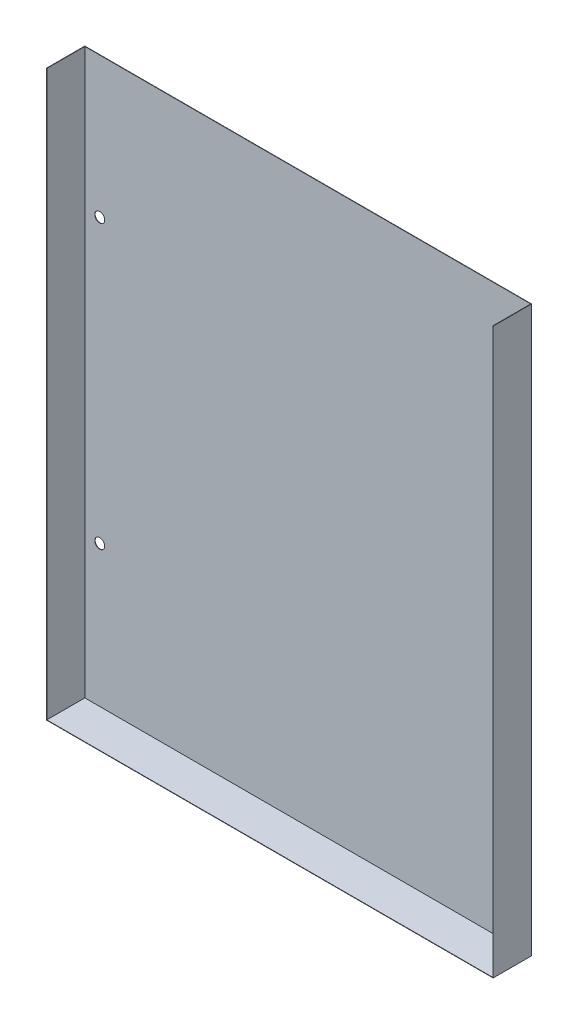
ISO-10303-21;
HEADER;
FILE_DESCRIPTION(('STEP AP214'),'2;1');
FILE_NAME('part.step','',(''),(''),'','','');
FILE_SCHEMA(('AUTOMOTIVE_DESIGN { 1 0 10303 214 1 1 1 1 }'));
ENDSEC;
DATA;
#1=APPLICATION_CONTEXT('core data for automotive mechanical design processes');
#2=APPLICATION_PROTOCOL_DEFINITION('international standard','automotive_design',2000,#1);
#3=PRODUCT_CONTEXT('',#1,'mechanical');
#4=PRODUCT('Part','Part','',(#3));
#5=PRODUCT_RELATED_PRODUCT_CATEGORY('part','',(#4));
#6=PRODUCT_DEFINITION_FORMATION('','',#4);
#7=PRODUCT_DEFINITION_CONTEXT('part definition',#1,'design');
#8=PRODUCT_DEFINITION('design','',#6,#7);
#9=PRODUCT_DEFINITION_SHAPE('','',#8);
#10=(LENGTH_UNIT() NAMED_UNIT(*) SI_UNIT(.MILLI.,.METRE.));
#11=(NAMED_UNIT(*) PLANE_ANGLE_UNIT() SI_UNIT($,.RADIAN.));
#12=(NAMED_UNIT(*) SI_UNIT($,.STERADIAN.) SOLID_ANGLE_UNIT());
#13=UNCERTAINTY_MEASURE_WITH_UNIT(LENGTH_MEASURE(1.E-05),#10,'distance_accuracy_value','');
#14=(GEOMETRIC_REPRESENTATION_CONTEXT(3) GLOBAL_UNCERTAINTY_ASSIGNED_CONTEXT((#13)) GLOBAL_UNIT_ASSIGNED_CONTEXT((#10,
#11,#12)) REPRESENTATION_CONTEXT('',''));
#15=CARTESIAN_POINT('',(0.,0.,0.));
#16=DIRECTION('',(0.,0.,1.));
#17=DIRECTION('',(1.,0.,0.));
#18=AXIS2_PLACEMENT_3D('',#15,#16,#17);
#19=CARTESIAN_POINT('',(0.,113.5,0.1524));
#20=DIRECTION('',(0.,1.,0.));
#21=DIRECTION('',(-1.,0.,0.));
#22=AXIS2_PLACEMENT_3D('',#19,#20,#21);
#23=PLANE('',#22);
#24=DIRECTION('',(1.,0.,0.));
#25=VECTOR('',#24,1.);
#26=CARTESIAN_POINT('',(0.,113.5,0.));
#27=LINE('',#26,#25);
#28=CARTESIAN_POINT('',(-89.8724,113.5,0.));
#29=VERTEX_POINT('',#28);
#30=CARTESIAN_POINT('',(89.8724,113.5,0.));
#31=VERTEX_POINT('',#30);
#32=EDGE_CURVE('E43',#29,#31,#27,.T.);
#33=ORIENTED_EDGE('',*,*,#32,.F.);
#34=DIRECTION('',(0.,0.,-1.));
#35=VECTOR('',#34,1.);
#36=CARTESIAN_POINT('',(-89.8724,113.5,15.45166));
#37=LINE('',#36,#35);
#38=CARTESIAN_POINT('',(-89.8724,113.5,15.45166));
#39=VERTEX_POINT('',#38);
#40=EDGE_CURVE('E173',#39,#29,#37,.T.);
#41=ORIENTED_EDGE('',*,*,#40,.F.);
#42=DIRECTION('',(-1.,0.,0.));
#43=VECTOR('',#42,1.);
#44=CARTESIAN_POINT('',(-89.8724,113.5,15.45166));
#45=LINE('',#44,#43);
#46=CARTESIAN_POINT('',(-89.72,113.5,15.45166));
#47=VERTEX_POINT('',#46);
#48=EDGE_CURVE('E167',#47,#39,#45,.T.);
#49=ORIENTED_EDGE('',*,*,#48,.F.);
#50=DIRECTION('',(0.,0.,-1.));
#51=VECTOR('',#50,1.);
#52=CARTESIAN_POINT('',(-89.72,113.5,15.45166));
#53=LINE('',#52,#51);
#54=CARTESIAN_POINT('',(-89.72,113.5,0.1524));
#55=VERTEX_POINT('',#54);
#56=EDGE_CURVE('E176',#47,#55,#53,.T.);
#57=ORIENTED_EDGE('',*,*,#56,.T.);
#58=DIRECTION('',(1.,0.,0.));
#59=VECTOR('',#58,1.);
#60=CARTESIAN_POINT('',(0.,113.5,0.1524));
#61=LINE('',#60,#59);
#62=CARTESIAN_POINT('',(89.72,113.5,0.1524));
#63=VERTEX_POINT('',#62);
#64=EDGE_CURVE('E187',#55,#63,#61,.T.);
#65=ORIENTED_EDGE('',*,*,#64,.T.);
#66=DIRECTION('',(0.,0.,-1.));
#67=VECTOR('',#66,1.);
#68=CARTESIAN_POINT('',(89.72,113.5,15.45166));
#69=LINE('',#68,#67);
#70=CARTESIAN_POINT('',(89.72,113.5,15.45166));
#71=VERTEX_POINT('',#70);
#72=EDGE_CURVE('E144',#71,#63,#69,.T.);
#73=ORIENTED_EDGE('',*,*,#72,.F.);
#74=DIRECTION('',(1.,0.,0.));
#75=VECTOR('',#74,1.);
#76=CARTESIAN_POINT('',(89.8724,113.5,15.45166));
#77=LINE('',#76,#75);
#78=CARTESIAN_POINT('',(89.8724,113.5,15.45166));
#79=VERTEX_POINT('',#78);
#80=EDGE_CURVE('E133',#71,#79,#77,.T.);
#81=ORIENTED_EDGE('',*,*,#80,.T.);
#82=DIRECTION('',(0.,0.,-1.));
#83=VECTOR('',#82,1.);
#84=CARTESIAN_POINT('',(89.8724,113.5,15.45166));
#85=LINE('',#84,#83);
#86=EDGE_CURVE('E129',#79,#31,#85,.T.);
#87=ORIENTED_EDGE('',*,*,#86,.T.);
#88=EDGE_LOOP('',(#33,#41,#49,#57,#65,#73,#81,#87));
#89=FACE_BOUND('',#88,.T.);
#90=ADVANCED_FACE('F39',(#89),#23,.T.);
#91=CARTESIAN_POINT('',(-83.72,-56.6738,0.1524));
#92=DIRECTION('',(0.,0.,-1.));
#93=DIRECTION('',(-1.,0.,0.));
#94=AXIS2_PLACEMENT_3D('',#91,#92,#93);
#95=CYLINDRICAL_SURFACE('',#94,2.);
#96=CARTESIAN_POINT('',(-83.72,-56.6738,0.1524));
#97=DIRECTION('',(0.,0.,1.));
#98=DIRECTION('',(1.,0.,0.));
#99=AXIS2_PLACEMENT_3D('',#96,#97,#98);
#100=CIRCLE('',#99,2.);
#101=CARTESIAN_POINT('',(-81.72,-56.6738,0.1524));
#102=VERTEX_POINT('',#101);
#103=EDGE_CURVE('E184',#102,#102,#100,.T.);
#104=ORIENTED_EDGE('',*,*,#103,.T.);
#105=EDGE_LOOP('',(#104));
#106=FACE_BOUND('',#105,.T.);
#107=CARTESIAN_POINT('',(-83.72,-56.6738,0.));
#108=DIRECTION('',(0.,0.,1.));
#109=DIRECTION('',(1.,0.,0.));
#110=AXIS2_PLACEMENT_3D('',#107,#108,#109);
#111=CIRCLE('',#110,2.);
#112=CARTESIAN_POINT('',(-81.72,-56.6738,0.));
#113=VERTEX_POINT('',#112);
#114=EDGE_CURVE('E191',#113,#113,#111,.T.);
#115=ORIENTED_EDGE('',*,*,#114,.F.);
#116=EDGE_LOOP('',(#115));
#117=FACE_BOUND('',#116,.T.);
#118=ADVANCED_FACE('F221',(#106,#117),#95,.F.);
#119=CARTESIAN_POINT('',(-83.72,56.9786,0.1524));
#120=DIRECTION('',(0.,0.,-1.));
#121=DIRECTION('',(-1.,0.,0.));
#122=AXIS2_PLACEMENT_3D('',#119,#120,#121);
#123=CYLINDRICAL_SURFACE('',#122,2.);
#124=CARTESIAN_POINT('',(-83.72,56.9786,0.1524));
#125=DIRECTION('',(0.,0.,1.));
#126=DIRECTION('',(1.,0.,0.));
#127=AXIS2_PLACEMENT_3D('',#124,#125,#126);
#128=CIRCLE('',#127,2.);
#129=CARTESIAN_POINT('',(-81.72,56.9786,0.1524));
#130=VERTEX_POINT('',#129);
#131=EDGE_CURVE('E181',#130,#130,#128,.T.);
#132=ORIENTED_EDGE('',*,*,#131,.T.);
#133=EDGE_LOOP('',(#132));
#134=FACE_BOUND('',#133,.T.);
#135=CARTESIAN_POINT('',(-83.72,56.9786,0.));
#136=DIRECTION('',(0.,0.,1.));
#137=DIRECTION('',(1.,0.,0.));
#138=AXIS2_PLACEMENT_3D('',#135,#136,#137);
#139=CIRCLE('',#138,2.);
#140=CARTESIAN_POINT('',(-81.72,56.9786,0.));
#141=VERTEX_POINT('',#140);
#142=EDGE_CURVE('E180',#141,#141,#139,.T.);
#143=ORIENTED_EDGE('',*,*,#142,.F.);
#144=EDGE_LOOP('',(#143));
#145=FACE_BOUND('',#144,.T.);
#146=ADVANCED_FACE('F41',(#134,#145),#123,.F.);
#147=CARTESIAN_POINT('',(0.,0.,0.1524));
#148=DIRECTION('',(0.,0.,1.));
#149=DIRECTION('',(1.,0.,0.));
#150=AXIS2_PLACEMENT_3D('',#147,#148,#149);
#151=PLANE('',#150);
#152=ORIENTED_EDGE('',*,*,#131,.F.);
#153=EDGE_LOOP('',(#152));
#154=FACE_BOUND('',#153,.T.);
#155=ORIENTED_EDGE('',*,*,#103,.F.);
#156=EDGE_LOOP('',(#155));
#157=FACE_BOUND('',#156,.T.);
#158=DIRECTION('',(1.,0.,0.));
#159=VECTOR('',#158,1.);
#160=CARTESIAN_POINT('',(0.,-113.5,0.1524));
#161=LINE('',#160,#159);
#162=CARTESIAN_POINT('',(-89.72,-113.5,0.1524));
#163=VERTEX_POINT('',#162);
#164=CARTESIAN_POINT('',(89.72,-113.5,0.1524));
#165=VERTEX_POINT('',#164);
#166=EDGE_CURVE('E11',#163,#165,#161,.T.);
#167=ORIENTED_EDGE('',*,*,#166,.T.);
#168=DIRECTION('',(0.,1.,0.));
#169=VECTOR('',#168,1.);
#170=CARTESIAN_POINT('',(89.72,0.,0.1524));
#171=LINE('',#170,#169);
#172=EDGE_CURVE('E155',#165,#63,#171,.T.);
#173=ORIENTED_EDGE('',*,*,#172,.T.);
#174=ORIENTED_EDGE('',*,*,#64,.F.);
#175=DIRECTION('',(0.,1.,0.));
#176=VECTOR('',#175,1.);
#177=CARTESIAN_POINT('',(-89.72,0.,0.1524));
#178=LINE('',#177,#176);
#179=EDGE_CURVE('E48',#163,#55,#178,.T.);
#180=ORIENTED_EDGE('',*,*,#179,.F.);
#181=EDGE_LOOP('',(#167,#173,#174,#180));
#182=FACE_BOUND('',#181,.T.);
#183=CARTESIAN_POINT('',(83.72,56.9786,0.1524));
#184=DIRECTION('',(0.,0.,-1.));
#185=DIRECTION('',(-1.,0.,0.));
#186=AXIS2_PLACEMENT_3D('',#183,#184,#185);
#187=CIRCLE('',#186,2.);
#188=CARTESIAN_POINT('',(81.72,56.9786,0.1524));
#189=VERTEX_POINT('',#188);
#190=EDGE_CURVE('E148',#189,#189,#187,.T.);
#191=ORIENTED_EDGE('',*,*,#190,.T.);
#192=EDGE_LOOP('',(#191));
#193=FACE_BOUND('',#192,.T.);
#194=CARTESIAN_POINT('',(83.72,-56.6738,0.1524));
#195=DIRECTION('',(0.,0.,-1.));
#196=DIRECTION('',(-1.,0.,0.));
#197=AXIS2_PLACEMENT_3D('',#194,#195,#196);
#198=CIRCLE('',#197,2.);
#199=CARTESIAN_POINT('',(81.72,-56.6738,0.1524));
#200=VERTEX_POINT('',#199);
#201=EDGE_CURVE('E151',#200,#200,#198,.T.);
#202=ORIENTED_EDGE('',*,*,#201,.T.);
#203=EDGE_LOOP('',(#202));
#204=FACE_BOUND('',#203,.T.);
#205=ADVANCED_FACE('F230',(#154,#157,#182,#193,#204),#151,.T.);
#206=CARTESIAN_POINT('',(0.,0.,0.));
#207=DIRECTION('',(0.,0.,1.));
#208=DIRECTION('',(1.,0.,0.));
#209=AXIS2_PLACEMENT_3D('',#206,#207,#208);
#210=PLANE('',#209);
#211=DIRECTION('',(0.,-1.,0.));
#212=VECTOR('',#211,1.);
#213=CARTESIAN_POINT('',(89.8724,113.5,0.));
#214=LINE('',#213,#212);
#215=CARTESIAN_POINT('',(89.8724,-113.6524,0.));
#216=VERTEX_POINT('',#215);
#217=EDGE_CURVE('E134',#31,#216,#214,.T.);
#218=ORIENTED_EDGE('',*,*,#217,.T.);
#219=DIRECTION('',(1.,0.,0.));
#220=VECTOR('',#219,1.);
#221=CARTESIAN_POINT('',(-89.8724,-113.6524,0.));
#222=LINE('',#221,#220);
#223=CARTESIAN_POINT('',(-89.8724,-113.6524,0.));
#224=VERTEX_POINT('',#223);
#225=EDGE_CURVE('E124',#224,#216,#222,.T.);
#226=ORIENTED_EDGE('',*,*,#225,.F.);
#227=DIRECTION('',(0.,-1.,0.));
#228=VECTOR('',#227,1.);
#229=CARTESIAN_POINT('',(-89.8724,113.5,0.));
#230=LINE('',#229,#228);
#231=EDGE_CURVE('E158',#29,#224,#230,.T.);
#232=ORIENTED_EDGE('',*,*,#231,.F.);
#233=ORIENTED_EDGE('',*,*,#32,.T.);
#234=EDGE_LOOP('',(#218,#226,#232,#233));
#235=FACE_BOUND('',#234,.T.);
#236=ORIENTED_EDGE('',*,*,#142,.T.);
#237=EDGE_LOOP('',(#236));
#238=FACE_BOUND('',#237,.T.);
#239=ORIENTED_EDGE('',*,*,#114,.T.);
#240=EDGE_LOOP('',(#239));
#241=FACE_BOUND('',#240,.T.);
#242=CARTESIAN_POINT('',(83.72,56.9786,0.));
#243=DIRECTION('',(0.,0.,-1.));
#244=DIRECTION('',(-1.,0.,0.));
#245=AXIS2_PLACEMENT_3D('',#242,#243,#244);
#246=CIRCLE('',#245,2.);
#247=CARTESIAN_POINT('',(81.72,56.9786,0.));
#248=VERTEX_POINT('',#247);
#249=EDGE_CURVE('E128',#248,#248,#246,.T.);
#250=ORIENTED_EDGE('',*,*,#249,.F.);
#251=EDGE_LOOP('',(#250));
#252=FACE_BOUND('',#251,.T.);
#253=CARTESIAN_POINT('',(83.72,-56.6738,0.));
#254=DIRECTION('',(0.,0.,-1.));
#255=DIRECTION('',(-1.,0.,0.));
#256=AXIS2_PLACEMENT_3D('',#253,#254,#255);
#257=CIRCLE('',#256,2.);
#258=CARTESIAN_POINT('',(81.72,-56.6738,0.));
#259=VERTEX_POINT('',#258);
#260=EDGE_CURVE('E152',#259,#259,#257,.T.);
#261=ORIENTED_EDGE('',*,*,#260,.F.);
#262=EDGE_LOOP('',(#261));
#263=FACE_BOUND('',#262,.T.);
#264=ADVANCED_FACE('F197',(#235,#238,#241,#252,#263),#210,.F.);
#265=CARTESIAN_POINT('',(-89.72,-113.5,15.45166));
#266=DIRECTION('',(0.,-1.,0.));
#267=DIRECTION('',(1.,0.,0.));
#268=AXIS2_PLACEMENT_3D('',#265,#266,#267);
#269=PLANE('',#268);
#270=ORIENTED_EDGE('',*,*,#166,.F.);
#271=DIRECTION('',(0.,0.,-1.));
#272=VECTOR('',#271,1.);
#273=CARTESIAN_POINT('',(-89.72,-113.5,15.45166));
#274=LINE('',#273,#272);
#275=CARTESIAN_POINT('',(-89.72,-113.5,15.45166));
#276=VERTEX_POINT('',#275);
#277=EDGE_CURVE('E178',#276,#163,#274,.T.);
#278=ORIENTED_EDGE('',*,*,#277,.F.);
#279=DIRECTION('',(-1.,0.,0.));
#280=VECTOR('',#279,1.);
#281=CARTESIAN_POINT('',(-89.72,-113.5,15.45166));
#282=LINE('',#281,#280);
#283=CARTESIAN_POINT('',(89.72,-113.5,15.45166));
#284=VERTEX_POINT('',#283);
#285=EDGE_CURVE('E163',#284,#276,#282,.T.);
#286=ORIENTED_EDGE('',*,*,#285,.F.);
#287=DIRECTION('',(0.,0.,-1.));
#288=VECTOR('',#287,1.);
#289=CARTESIAN_POINT('',(89.72,-113.5,15.45166));
#290=LINE('',#289,#288);
#291=EDGE_CURVE('E141',#284,#165,#290,.T.);
#292=ORIENTED_EDGE('',*,*,#291,.T.);
#293=EDGE_LOOP('',(#270,#278,#286,#292));
#294=FACE_BOUND('',#293,.T.);
#295=ADVANCED_FACE('F206',(#294),#269,.F.);
#296=CARTESIAN_POINT('',(-89.72,-113.5,15.45166));
#297=DIRECTION('',(-1.,0.,0.));
#298=DIRECTION('',(0.,0.,1.));
#299=AXIS2_PLACEMENT_3D('',#296,#297,#298);
#300=PLANE('',#299);
#301=ORIENTED_EDGE('',*,*,#179,.T.);
#302=ORIENTED_EDGE('',*,*,#56,.F.);
#303=DIRECTION('',(0.,1.,0.));
#304=VECTOR('',#303,1.);
#305=CARTESIAN_POINT('',(-89.72,-113.5,15.45166));
#306=LINE('',#305,#304);
#307=EDGE_CURVE('E165',#276,#47,#306,.T.);
#308=ORIENTED_EDGE('',*,*,#307,.F.);
#309=ORIENTED_EDGE('',*,*,#277,.T.);
#310=EDGE_LOOP('',(#301,#302,#308,#309));
#311=FACE_BOUND('',#310,.T.);
#312=ADVANCED_FACE('F208',(#311),#300,.F.);
#313=CARTESIAN_POINT('',(-89.8724,113.5,15.45166));
#314=DIRECTION('',(1.,0.,0.));
#315=DIRECTION('',(0.,0.,-1.));
#316=AXIS2_PLACEMENT_3D('',#313,#314,#315);
#317=PLANE('',#316);
#318=ORIENTED_EDGE('',*,*,#231,.T.);
#319=DIRECTION('',(0.,0.,-1.));
#320=VECTOR('',#319,1.);
#321=CARTESIAN_POINT('',(-89.8724,-113.6524,15.45166));
#322=LINE('',#321,#320);
#323=CARTESIAN_POINT('',(-89.8724,-113.6524,15.45166));
#324=VERTEX_POINT('',#323);
#325=EDGE_CURVE('E118',#324,#224,#322,.T.);
#326=ORIENTED_EDGE('',*,*,#325,.F.);
#327=DIRECTION('',(0.,-1.,0.));
#328=VECTOR('',#327,1.);
#329=CARTESIAN_POINT('',(-89.8724,113.5,15.45166));
#330=LINE('',#329,#328);
#331=EDGE_CURVE('E114',#39,#324,#330,.T.);
#332=ORIENTED_EDGE('',*,*,#331,.F.);
#333=ORIENTED_EDGE('',*,*,#40,.T.);
#334=EDGE_LOOP('',(#318,#326,#332,#333));
#335=FACE_BOUND('',#334,.T.);
#336=ADVANCED_FACE('F211',(#335),#317,.F.);
#337=CARTESIAN_POINT('',(-89.8724,-113.6524,15.45166));
#338=DIRECTION('',(0.,1.,0.));
#339=DIRECTION('',(-1.,0.,0.));
#340=AXIS2_PLACEMENT_3D('',#337,#338,#339);
#341=PLANE('',#340);
#342=ORIENTED_EDGE('',*,*,#225,.T.);
#343=DIRECTION('',(0.,0.,-1.));
#344=VECTOR('',#343,1.);
#345=CARTESIAN_POINT('',(89.8724,-113.6524,15.45166));
#346=LINE('',#345,#344);
#347=CARTESIAN_POINT('',(89.8724,-113.6524,15.45166));
#348=VERTEX_POINT('',#347);
#349=EDGE_CURVE('E121',#348,#216,#346,.T.);
#350=ORIENTED_EDGE('',*,*,#349,.F.);
#351=DIRECTION('',(1.,0.,0.));
#352=VECTOR('',#351,1.);
#353=CARTESIAN_POINT('',(-89.8724,-113.6524,15.45166));
#354=LINE('',#353,#352);
#355=EDGE_CURVE('E105',#324,#348,#354,.T.);
#356=ORIENTED_EDGE('',*,*,#355,.F.);
#357=ORIENTED_EDGE('',*,*,#325,.T.);
#358=EDGE_LOOP('',(#342,#350,#356,#357));
#359=FACE_BOUND('',#358,.T.);
#360=ADVANCED_FACE('F122',(#359),#341,.F.);
#361=CARTESIAN_POINT('',(0.,0.,15.45166));
#362=DIRECTION('',(0.,0.,1.));
#363=DIRECTION('',(1.,0.,0.));
#364=AXIS2_PLACEMENT_3D('',#361,#362,#363);
#365=PLANE('',#364);
#366=ORIENTED_EDGE('',*,*,#285,.T.);
#367=ORIENTED_EDGE('',*,*,#307,.T.);
#368=ORIENTED_EDGE('',*,*,#48,.T.);
#369=ORIENTED_EDGE('',*,*,#331,.T.);
#370=ORIENTED_EDGE('',*,*,#355,.T.);
#371=DIRECTION('',(0.,-1.,0.));
#372=VECTOR('',#371,1.);
#373=CARTESIAN_POINT('',(89.8724,113.5,15.45166));
#374=LINE('',#373,#372);
#375=EDGE_CURVE('E111',#79,#348,#374,.T.);
#376=ORIENTED_EDGE('',*,*,#375,.F.);
#377=ORIENTED_EDGE('',*,*,#80,.F.);
#378=DIRECTION('',(0.,1.,0.));
#379=VECTOR('',#378,1.);
#380=CARTESIAN_POINT('',(89.72,-113.5,15.45166));
#381=LINE('',#380,#379);
#382=EDGE_CURVE('E136',#284,#71,#381,.T.);
#383=ORIENTED_EDGE('',*,*,#382,.F.);
#384=EDGE_LOOP('',(#366,#367,#368,#369,#370,#376,#377,#383));
#385=FACE_BOUND('',#384,.T.);
#386=ADVANCED_FACE('F108',(#385),#365,.T.);
#387=CARTESIAN_POINT('',(83.72,-56.6738,0.1524));
#388=DIRECTION('',(0.,0.,-1.));
#389=DIRECTION('',(-1.,0.,0.));
#390=AXIS2_PLACEMENT_3D('',#387,#388,#389);
#391=CYLINDRICAL_SURFACE('',#390,2.);
#392=ORIENTED_EDGE('',*,*,#201,.F.);
#393=EDGE_LOOP('',(#392));
#394=FACE_BOUND('',#393,.T.);
#395=ORIENTED_EDGE('',*,*,#260,.T.);
#396=EDGE_LOOP('',(#395));
#397=FACE_BOUND('',#396,.T.);
#398=ADVANCED_FACE('F298',(#394,#397),#391,.F.);
#399=CARTESIAN_POINT('',(83.72,56.9786,0.1524));
#400=DIRECTION('',(0.,0.,-1.));
#401=DIRECTION('',(-1.,0.,0.));
#402=AXIS2_PLACEMENT_3D('',#399,#400,#401);
#403=CYLINDRICAL_SURFACE('',#402,2.);
#404=ORIENTED_EDGE('',*,*,#190,.F.);
#405=EDGE_LOOP('',(#404));
#406=FACE_BOUND('',#405,.T.);
#407=ORIENTED_EDGE('',*,*,#249,.T.);
#408=EDGE_LOOP('',(#407));
#409=FACE_BOUND('',#408,.T.);
#410=ADVANCED_FACE('F309',(#406,#409),#403,.F.);
#411=CARTESIAN_POINT('',(89.8724,113.5,15.45166));
#412=DIRECTION('',(1.,0.,0.));
#413=DIRECTION('',(0.,0.,-1.));
#414=AXIS2_PLACEMENT_3D('',#411,#412,#413);
#415=PLANE('',#414);
#416=ORIENTED_EDGE('',*,*,#217,.F.);
#417=ORIENTED_EDGE('',*,*,#86,.F.);
#418=ORIENTED_EDGE('',*,*,#375,.T.);
#419=ORIENTED_EDGE('',*,*,#349,.T.);
#420=EDGE_LOOP('',(#416,#417,#418,#419));
#421=FACE_BOUND('',#420,.T.);
#422=ADVANCED_FACE('F131',(#421),#415,.T.);
#423=CARTESIAN_POINT('',(89.72,-113.5,15.45166));
#424=DIRECTION('',(-1.,0.,0.));
#425=DIRECTION('',(0.,0.,1.));
#426=AXIS2_PLACEMENT_3D('',#423,#424,#425);
#427=PLANE('',#426);
#428=ORIENTED_EDGE('',*,*,#72,.T.);
#429=ORIENTED_EDGE('',*,*,#172,.F.);
#430=ORIENTED_EDGE('',*,*,#291,.F.);
#431=ORIENTED_EDGE('',*,*,#382,.T.);
#432=EDGE_LOOP('',(#428,#429,#430,#431));
#433=FACE_BOUND('',#432,.T.);
#434=ADVANCED_FACE('F204',(#433),#427,.T.);
#435=CLOSED_SHELL('',(#90,#118,#146,#205,#264,#295,#312,#336,#360,#386,#398,#410,#422,#434));
#436=MANIFOLD_SOLID_BREP('B2',#435);
#437=ADVANCED_BREP_SHAPE_REPRESENTATION('',(#18,#436),#14);
#438=SHAPE_DEFINITION_REPRESENTATION(#9,#437);
ENDSEC;
END-ISO-10303-21;
